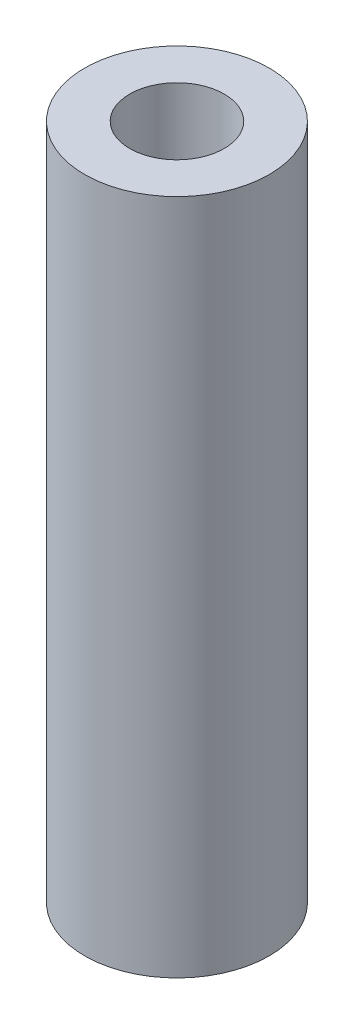
ISO-10303-21;
HEADER;
FILE_DESCRIPTION(('STEP AP214'),'2;1');
FILE_NAME('part.step','',(''),(''),'','','');
FILE_SCHEMA(('AUTOMOTIVE_DESIGN { 1 0 10303 214 1 1 1 1 }'));
ENDSEC;
DATA;
#1=APPLICATION_CONTEXT('core data for automotive mechanical design processes');
#2=APPLICATION_PROTOCOL_DEFINITION('international standard','automotive_design',2000,#1);
#3=PRODUCT_CONTEXT('',#1,'mechanical');
#4=PRODUCT('Part','Part','',(#3));
#5=PRODUCT_RELATED_PRODUCT_CATEGORY('part','',(#4));
#6=PRODUCT_DEFINITION_FORMATION('','',#4);
#7=PRODUCT_DEFINITION_CONTEXT('part definition',#1,'design');
#8=PRODUCT_DEFINITION('design','',#6,#7);
#9=PRODUCT_DEFINITION_SHAPE('','',#8);
#10=(LENGTH_UNIT() NAMED_UNIT(*) SI_UNIT(.MILLI.,.METRE.));
#11=(NAMED_UNIT(*) PLANE_ANGLE_UNIT() SI_UNIT($,.RADIAN.));
#12=(NAMED_UNIT(*) SI_UNIT($,.STERADIAN.) SOLID_ANGLE_UNIT());
#13=UNCERTAINTY_MEASURE_WITH_UNIT(LENGTH_MEASURE(1.E-05),#10,'distance_accuracy_value','');
#14=(GEOMETRIC_REPRESENTATION_CONTEXT(3) GLOBAL_UNCERTAINTY_ASSIGNED_CONTEXT((#13)) GLOBAL_UNIT_ASSIGNED_CONTEXT((#10,
#11,#12)) REPRESENTATION_CONTEXT('',''));
#15=CARTESIAN_POINT('',(0.,0.,0.));
#16=DIRECTION('',(0.,0.,1.));
#17=DIRECTION('',(1.,0.,0.));
#18=AXIS2_PLACEMENT_3D('',#15,#16,#17);
#19=CARTESIAN_POINT('',(0.,0.,0.));
#20=DIRECTION('',(0.,1.,0.));
#21=DIRECTION('',(1.,0.,0.));
#22=AXIS2_PLACEMENT_3D('',#19,#20,#21);
#23=PLANE('',#22);
#24=CARTESIAN_POINT('',(0.,0.,0.));
#25=DIRECTION('',(0.,-1.,0.));
#26=DIRECTION('',(1.,0.,0.));
#27=AXIS2_PLACEMENT_3D('',#24,#25,#26);
#28=CIRCLE('',#27,2.4384);
#29=CARTESIAN_POINT('',(-2.4384,0.,0.));
#30=VERTEX_POINT('',#29);
#31=EDGE_CURVE('E57',#30,#30,#28,.T.);
#32=ORIENTED_EDGE('',*,*,#31,.F.);
#33=EDGE_LOOP('',(#32));
#34=FACE_BOUND('',#33,.T.);
#35=CARTESIAN_POINT('',(0.,0.,0.));
#36=DIRECTION('',(0.,1.,0.));
#37=DIRECTION('',(-1.,0.,0.));
#38=AXIS2_PLACEMENT_3D('',#35,#36,#37);
#39=CIRCLE('',#38,4.7625);
#40=CARTESIAN_POINT('',(4.7625,0.,0.));
#41=VERTEX_POINT('',#40);
#42=EDGE_CURVE('E11',#41,#41,#39,.T.);
#43=ORIENTED_EDGE('',*,*,#42,.F.);
#44=EDGE_LOOP('',(#43));
#45=FACE_BOUND('',#44,.T.);
#46=ADVANCED_FACE('F17',(#34,#45),#23,.F.);
#47=CARTESIAN_POINT('',(0.,34.925,0.));
#48=DIRECTION('',(0.,1.,0.));
#49=DIRECTION('',(1.,0.,0.));
#50=AXIS2_PLACEMENT_3D('',#47,#48,#49);
#51=PLANE('',#50);
#52=CARTESIAN_POINT('',(0.,34.925,0.));
#53=DIRECTION('',(0.,-1.,0.));
#54=DIRECTION('',(1.,0.,0.));
#55=AXIS2_PLACEMENT_3D('',#52,#53,#54);
#56=CIRCLE('',#55,2.4384);
#57=CARTESIAN_POINT('',(-2.4384,34.925,0.));
#58=VERTEX_POINT('',#57);
#59=EDGE_CURVE('E55',#58,#58,#56,.T.);
#60=ORIENTED_EDGE('',*,*,#59,.T.);
#61=EDGE_LOOP('',(#60));
#62=FACE_BOUND('',#61,.T.);
#63=CARTESIAN_POINT('',(0.,34.925,0.));
#64=DIRECTION('',(0.,1.,0.));
#65=DIRECTION('',(-1.,0.,0.));
#66=AXIS2_PLACEMENT_3D('',#63,#64,#65);
#67=CIRCLE('',#66,4.7625);
#68=CARTESIAN_POINT('',(4.7625,34.925,0.));
#69=VERTEX_POINT('',#68);
#70=EDGE_CURVE('E70',#69,#69,#67,.T.);
#71=ORIENTED_EDGE('',*,*,#70,.T.);
#72=EDGE_LOOP('',(#71));
#73=FACE_BOUND('',#72,.T.);
#74=ADVANCED_FACE('F61',(#62,#73),#51,.T.);
#75=CARTESIAN_POINT('',(0.,0.,0.));
#76=DIRECTION('',(0.,1.,0.));
#77=DIRECTION('',(-1.,0.,0.));
#78=AXIS2_PLACEMENT_3D('',#75,#76,#77);
#79=CYLINDRICAL_SURFACE('',#78,4.7625);
#80=ORIENTED_EDGE('',*,*,#70,.F.);
#81=DIRECTION('',(0.,-1.,0.));
#82=VECTOR('',#81,1.);
#83=CARTESIAN_POINT('',(4.7625,0.,0.));
#84=LINE('',#83,#82);
#85=EDGE_CURVE('E25',#69,#41,#84,.T.);
#86=ORIENTED_EDGE('',*,*,#85,.T.);
#87=ORIENTED_EDGE('',*,*,#42,.T.);
#88=ORIENTED_EDGE('',*,*,#85,.F.);
#89=EDGE_LOOP('',(#80,#86,#87,#88));
#90=FACE_BOUND('',#89,.T.);
#91=ADVANCED_FACE('F75',(#90),#79,.T.);
#92=CARTESIAN_POINT('',(0.,0.,0.));
#93=DIRECTION('',(0.,1.,0.));
#94=DIRECTION('',(1.,0.,0.));
#95=AXIS2_PLACEMENT_3D('',#92,#93,#94);
#96=CYLINDRICAL_SURFACE('',#95,2.4384);
#97=ORIENTED_EDGE('',*,*,#59,.F.);
#98=DIRECTION('',(0.,-1.,0.));
#99=VECTOR('',#98,1.);
#100=CARTESIAN_POINT('',(-2.4384,0.,0.));
#101=LINE('',#100,#99);
#102=EDGE_CURVE('E52',#58,#30,#101,.T.);
#103=ORIENTED_EDGE('',*,*,#102,.T.);
#104=ORIENTED_EDGE('',*,*,#31,.T.);
#105=ORIENTED_EDGE('',*,*,#102,.F.);
#106=EDGE_LOOP('',(#97,#103,#104,#105));
#107=FACE_BOUND('',#106,.T.);
#108=ADVANCED_FACE('F54',(#107),#96,.F.);
#109=CLOSED_SHELL('',(#46,#74,#91,#108));
#110=MANIFOLD_SOLID_BREP('B1',#109);
#111=ADVANCED_BREP_SHAPE_REPRESENTATION('',(#18,#110),#14);
#112=SHAPE_DEFINITION_REPRESENTATION(#9,#111);
ENDSEC;
END-ISO-10303-21;
